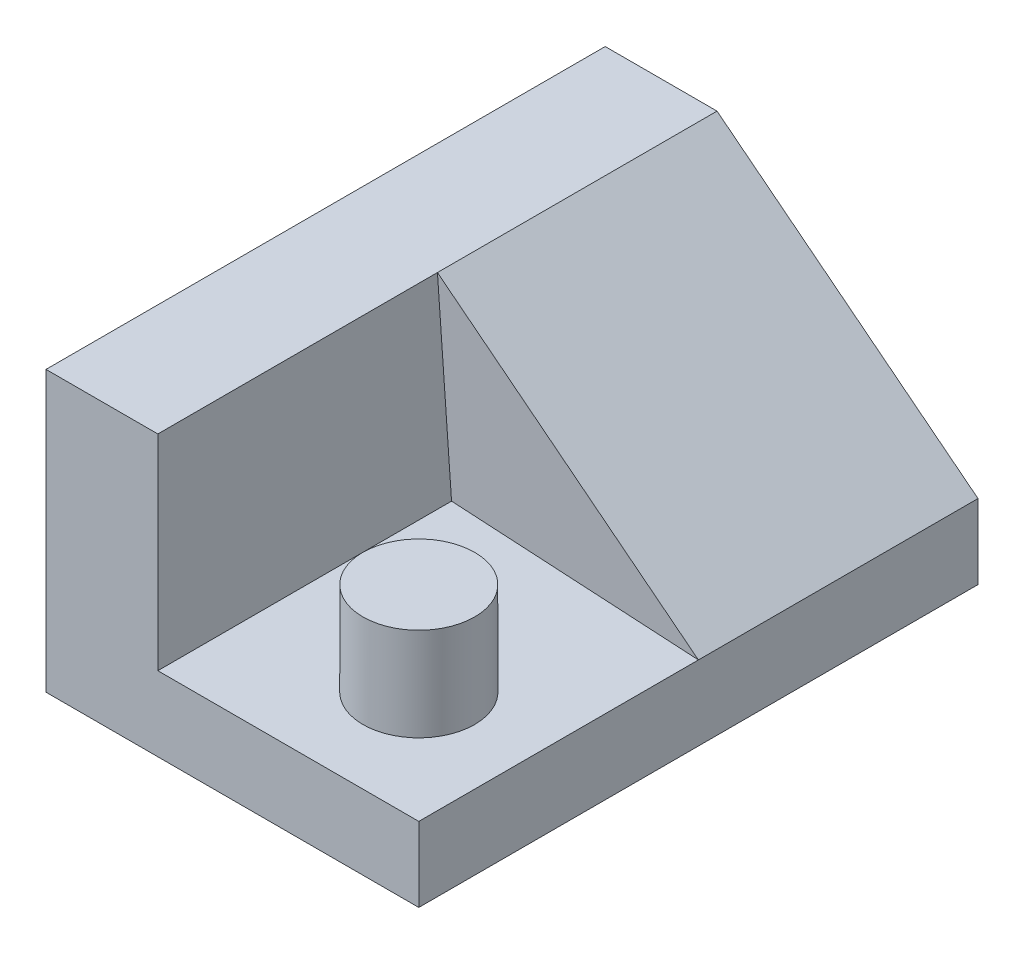
ISO-10303-21;
HEADER;
FILE_DESCRIPTION(('STEP AP214'),'2;1');
FILE_NAME('part.step','',(''),(''),'','','');
FILE_SCHEMA(('AUTOMOTIVE_DESIGN { 1 0 10303 214 1 1 1 1 }'));
ENDSEC;
DATA;
#1=APPLICATION_CONTEXT('core data for automotive mechanical design processes');
#2=APPLICATION_PROTOCOL_DEFINITION('international standard','automotive_design',2000,#1);
#3=PRODUCT_CONTEXT('',#1,'mechanical');
#4=PRODUCT('Part','Part','',(#3));
#5=PRODUCT_RELATED_PRODUCT_CATEGORY('part','',(#4));
#6=PRODUCT_DEFINITION_FORMATION('','',#4);
#7=PRODUCT_DEFINITION_CONTEXT('part definition',#1,'design');
#8=PRODUCT_DEFINITION('design','',#6,#7);
#9=PRODUCT_DEFINITION_SHAPE('','',#8);
#10=(LENGTH_UNIT() NAMED_UNIT(*) SI_UNIT(.MILLI.,.METRE.));
#11=(NAMED_UNIT(*) PLANE_ANGLE_UNIT() SI_UNIT($,.RADIAN.));
#12=(NAMED_UNIT(*) SI_UNIT($,.STERADIAN.) SOLID_ANGLE_UNIT());
#13=UNCERTAINTY_MEASURE_WITH_UNIT(LENGTH_MEASURE(1.E-05),#10,'distance_accuracy_value','');
#14=(GEOMETRIC_REPRESENTATION_CONTEXT(3) GLOBAL_UNCERTAINTY_ASSIGNED_CONTEXT((#13)) GLOBAL_UNIT_ASSIGNED_CONTEXT((#10,
#11,#12)) REPRESENTATION_CONTEXT('',''));
#15=CARTESIAN_POINT('',(0.,0.,0.));
#16=DIRECTION('',(0.,0.,1.));
#17=DIRECTION('',(1.,0.,0.));
#18=AXIS2_PLACEMENT_3D('',#15,#16,#17);
#19=CARTESIAN_POINT('',(100.,20.,150.));
#20=DIRECTION('',(0.,-1.,0.));
#21=DIRECTION('',(1.,0.,0.));
#22=AXIS2_PLACEMENT_3D('',#19,#20,#21);
#23=PLANE('',#22);
#24=DIRECTION('',(-0.998542363269422,0.,0.0539735931388368));
#25=VECTOR('',#24,1.);
#26=CARTESIAN_POINT('',(91.9157621129505,20.,0.43697231344747));
#27=LINE('',#26,#25);
#28=CARTESIAN_POINT('',(100.,20.,0.));
#29=VERTEX_POINT('',#28);
#30=CARTESIAN_POINT('',(30.,20.,3.78366673132242));
#31=VERTEX_POINT('',#30);
#32=EDGE_CURVE('E224',#29,#31,#27,.T.);
#33=ORIENTED_EDGE('',*,*,#32,.F.);
#34=DIRECTION('',(-1.,0.,0.));
#35=VECTOR('',#34,1.);
#36=CARTESIAN_POINT('',(100.,20.,0.));
#37=LINE('',#36,#35);
#38=CARTESIAN_POINT('',(30.,20.,0.));
#39=VERTEX_POINT('',#38);
#40=EDGE_CURVE('E134',#29,#39,#37,.T.);
#41=ORIENTED_EDGE('',*,*,#40,.T.);
#42=DIRECTION('',(0.,0.,-1.));
#43=VECTOR('',#42,1.);
#44=CARTESIAN_POINT('',(30.,20.,150.));
#45=LINE('',#44,#43);
#46=EDGE_CURVE('E116',#31,#39,#45,.T.);
#47=ORIENTED_EDGE('',*,*,#46,.F.);
#48=EDGE_LOOP('',(#33,#41,#47));
#49=FACE_BOUND('',#48,.T.);
#50=ADVANCED_FACE('F33',(#49),#23,.F.);
#51=CARTESIAN_POINT('',(30.,20.,150.));
#52=DIRECTION('',(-1.,0.,0.));
#53=DIRECTION('',(0.,0.,1.));
#54=AXIS2_PLACEMENT_3D('',#51,#52,#53);
#55=PLANE('',#54);
#56=DIRECTION('',(0.,0.997642062968162,-0.0686317287894636));
#57=VECTOR('',#56,1.);
#58=CARTESIAN_POINT('',(30.,9.9885823566259,4.47239160169713));
#59=LINE('',#58,#57);
#60=CARTESIAN_POINT('',(30.,75.,0.));
#61=VERTEX_POINT('',#60);
#62=EDGE_CURVE('E226',#31,#61,#59,.T.);
#63=ORIENTED_EDGE('',*,*,#62,.F.);
#64=ORIENTED_EDGE('',*,*,#46,.T.);
#65=DIRECTION('',(0.,1.,0.));
#66=VECTOR('',#65,1.);
#67=CARTESIAN_POINT('',(30.,20.,0.));
#68=LINE('',#67,#66);
#69=EDGE_CURVE('E137',#39,#61,#68,.T.);
#70=ORIENTED_EDGE('',*,*,#69,.T.);
#71=EDGE_LOOP('',(#63,#64,#70));
#72=FACE_BOUND('',#71,.T.);
#73=ADVANCED_FACE('F157',(#72),#55,.F.);
#74=CARTESIAN_POINT('',(0.,75.,150.));
#75=DIRECTION('',(1.,0.,0.));
#76=DIRECTION('',(0.,1.,0.));
#77=AXIS2_PLACEMENT_3D('',#74,#75,#76);
#78=PLANE('',#77);
#79=DIRECTION('',(0.,0.,-1.));
#80=VECTOR('',#79,1.);
#81=CARTESIAN_POINT('',(0.,75.,150.));
#82=LINE('',#81,#80);
#83=CARTESIAN_POINT('',(0.,75.,150.));
#84=VERTEX_POINT('',#83);
#85=CARTESIAN_POINT('',(0.,75.,0.));
#86=VERTEX_POINT('',#85);
#87=EDGE_CURVE('E78',#84,#86,#82,.T.);
#88=ORIENTED_EDGE('',*,*,#87,.T.);
#89=DIRECTION('',(0.,-1.,0.));
#90=VECTOR('',#89,1.);
#91=CARTESIAN_POINT('',(0.,75.,0.));
#92=LINE('',#91,#90);
#93=CARTESIAN_POINT('',(0.,0.,0.));
#94=VERTEX_POINT('',#93);
#95=EDGE_CURVE('E125',#86,#94,#92,.T.);
#96=ORIENTED_EDGE('',*,*,#95,.T.);
#97=DIRECTION('',(0.,0.,-1.));
#98=VECTOR('',#97,1.);
#99=CARTESIAN_POINT('',(0.,0.,150.));
#100=LINE('',#99,#98);
#101=CARTESIAN_POINT('',(0.,0.,150.));
#102=VERTEX_POINT('',#101);
#103=EDGE_CURVE('E42',#102,#94,#100,.T.);
#104=ORIENTED_EDGE('',*,*,#103,.F.);
#105=DIRECTION('',(0.,-1.,0.));
#106=VECTOR('',#105,1.);
#107=CARTESIAN_POINT('',(0.,75.,150.));
#108=LINE('',#107,#106);
#109=EDGE_CURVE('E142',#84,#102,#108,.T.);
#110=ORIENTED_EDGE('',*,*,#109,.F.);
#111=EDGE_LOOP('',(#88,#96,#104,#110));
#112=FACE_BOUND('',#111,.T.);
#113=ADVANCED_FACE('F35',(#112),#78,.F.);
#114=CARTESIAN_POINT('',(0.,0.,150.));
#115=DIRECTION('',(0.,1.,0.));
#116=DIRECTION('',(0.,0.,1.));
#117=AXIS2_PLACEMENT_3D('',#114,#115,#116);
#118=PLANE('',#117);
#119=ORIENTED_EDGE('',*,*,#103,.T.);
#120=DIRECTION('',(1.,0.,0.));
#121=VECTOR('',#120,1.);
#122=CARTESIAN_POINT('',(0.,0.,0.));
#123=LINE('',#122,#121);
#124=CARTESIAN_POINT('',(100.,0.,0.));
#125=VERTEX_POINT('',#124);
#126=EDGE_CURVE('E127',#94,#125,#123,.T.);
#127=ORIENTED_EDGE('',*,*,#126,.T.);
#128=DIRECTION('',(0.,0.,-1.));
#129=VECTOR('',#128,1.);
#130=CARTESIAN_POINT('',(100.,0.,150.));
#131=LINE('',#130,#129);
#132=CARTESIAN_POINT('',(100.,0.,150.));
#133=VERTEX_POINT('',#132);
#134=EDGE_CURVE('E146',#133,#125,#131,.T.);
#135=ORIENTED_EDGE('',*,*,#134,.F.);
#136=DIRECTION('',(1.,0.,0.));
#137=VECTOR('',#136,1.);
#138=CARTESIAN_POINT('',(0.,0.,150.));
#139=LINE('',#138,#137);
#140=EDGE_CURVE('E86',#102,#133,#139,.T.);
#141=ORIENTED_EDGE('',*,*,#140,.F.);
#142=EDGE_LOOP('',(#119,#127,#135,#141));
#143=FACE_BOUND('',#142,.T.);
#144=ADVANCED_FACE('F149',(#143),#118,.F.);
#145=CARTESIAN_POINT('',(100.,0.,150.));
#146=DIRECTION('',(-1.,0.,0.));
#147=DIRECTION('',(0.,0.,1.));
#148=AXIS2_PLACEMENT_3D('',#145,#146,#147);
#149=PLANE('',#148);
#150=ORIENTED_EDGE('',*,*,#134,.T.);
#151=DIRECTION('',(0.,1.,0.));
#152=VECTOR('',#151,1.);
#153=CARTESIAN_POINT('',(100.,0.,0.));
#154=LINE('',#153,#152);
#155=EDGE_CURVE('E131',#125,#29,#154,.T.);
#156=ORIENTED_EDGE('',*,*,#155,.T.);
#157=DIRECTION('',(0.,0.,-1.));
#158=VECTOR('',#157,1.);
#159=CARTESIAN_POINT('',(100.,20.,150.));
#160=LINE('',#159,#158);
#161=CARTESIAN_POINT('',(100.,20.,75.));
#162=VERTEX_POINT('',#161);
#163=EDGE_CURVE('E217',#29,#162,#160,.F.);
#164=ORIENTED_EDGE('',*,*,#163,.T.);
#165=DIRECTION('',(0.,0.,-1.));
#166=VECTOR('',#165,1.);
#167=CARTESIAN_POINT('',(100.,20.,150.));
#168=LINE('',#167,#166);
#169=CARTESIAN_POINT('',(100.,20.,150.));
#170=VERTEX_POINT('',#169);
#171=EDGE_CURVE('E115',#170,#162,#168,.T.);
#172=ORIENTED_EDGE('',*,*,#171,.F.);
#173=DIRECTION('',(0.,1.,0.));
#174=VECTOR('',#173,1.);
#175=CARTESIAN_POINT('',(100.,0.,150.));
#176=LINE('',#175,#174);
#177=EDGE_CURVE('E102',#133,#170,#176,.T.);
#178=ORIENTED_EDGE('',*,*,#177,.F.);
#179=EDGE_LOOP('',(#150,#156,#164,#172,#178));
#180=FACE_BOUND('',#179,.T.);
#181=ADVANCED_FACE('F162',(#180),#149,.F.);
#182=CARTESIAN_POINT('',(70.,20.,120.));
#183=DIRECTION('',(0.,-1.,0.));
#184=DIRECTION('',(1.,0.,0.));
#185=AXIS2_PLACEMENT_3D('',#182,#183,#184);
#186=CIRCLE('',#185,15.);
#187=CARTESIAN_POINT('',(85.,20.,120.));
#188=VERTEX_POINT('',#187);
#189=EDGE_CURVE('E11',#188,#188,#186,.F.);
#190=ORIENTED_EDGE('',*,*,#189,.F.);
#191=EDGE_LOOP('',(#190));
#192=FACE_BOUND('',#191,.T.);
#193=ORIENTED_EDGE('',*,*,#171,.T.);
#194=DIRECTION('',(-0.998542363269422,0.,-0.0539735931388368));
#195=VECTOR('',#194,1.);
#196=CARTESIAN_POINT('',(104.042118943525,20.,75.2184861567237));
#197=LINE('',#196,#195);
#198=CARTESIAN_POINT('',(30.,20.,71.2163332686776));
#199=VERTEX_POINT('',#198);
#200=EDGE_CURVE('E112',#162,#199,#197,.T.);
#201=ORIENTED_EDGE('',*,*,#200,.T.);
#202=CARTESIAN_POINT('',(30.,20.,150.));
#203=VERTEX_POINT('',#202);
#204=EDGE_CURVE('E109',#203,#199,#45,.T.);
#205=ORIENTED_EDGE('',*,*,#204,.F.);
#206=DIRECTION('',(-1.,0.,0.));
#207=VECTOR('',#206,1.);
#208=CARTESIAN_POINT('',(100.,20.,150.));
#209=LINE('',#208,#207);
#210=EDGE_CURVE('E95',#170,#203,#209,.T.);
#211=ORIENTED_EDGE('',*,*,#210,.F.);
#212=EDGE_LOOP('',(#193,#201,#205,#211));
#213=FACE_BOUND('',#212,.T.);
#214=ADVANCED_FACE('F110',(#192,#213),#23,.F.);
#215=ORIENTED_EDGE('',*,*,#204,.T.);
#216=DIRECTION('',(0.,0.997642062968162,0.0686317287894636));
#217=VECTOR('',#216,1.);
#218=CARTESIAN_POINT('',(30.,25.3943097429091,71.5874290925447));
#219=LINE('',#218,#217);
#220=CARTESIAN_POINT('',(30.,75.,75.));
#221=VERTEX_POINT('',#220);
#222=EDGE_CURVE('E220',#199,#221,#219,.T.);
#223=ORIENTED_EDGE('',*,*,#222,.T.);
#224=DIRECTION('',(0.,0.,-1.));
#225=VECTOR('',#224,1.);
#226=CARTESIAN_POINT('',(30.,75.,150.));
#227=LINE('',#226,#225);
#228=CARTESIAN_POINT('',(30.,75.,150.));
#229=VERTEX_POINT('',#228);
#230=EDGE_CURVE('E120',#229,#221,#227,.T.);
#231=ORIENTED_EDGE('',*,*,#230,.F.);
#232=DIRECTION('',(0.,1.,0.));
#233=VECTOR('',#232,1.);
#234=CARTESIAN_POINT('',(30.,20.,150.));
#235=LINE('',#234,#233);
#236=EDGE_CURVE('E99',#203,#229,#235,.T.);
#237=ORIENTED_EDGE('',*,*,#236,.F.);
#238=EDGE_LOOP('',(#215,#223,#231,#237));
#239=FACE_BOUND('',#238,.T.);
#240=ADVANCED_FACE('F118',(#239),#55,.F.);
#241=CARTESIAN_POINT('',(30.,75.,150.));
#242=DIRECTION('',(0.,-1.,0.));
#243=DIRECTION('',(0.,0.,-1.));
#244=AXIS2_PLACEMENT_3D('',#241,#242,#243);
#245=PLANE('',#244);
#246=ORIENTED_EDGE('',*,*,#230,.T.);
#247=DIRECTION('',(0.,0.,-1.));
#248=VECTOR('',#247,1.);
#249=CARTESIAN_POINT('',(30.,75.,150.));
#250=LINE('',#249,#248);
#251=EDGE_CURVE('E206',#61,#221,#250,.F.);
#252=ORIENTED_EDGE('',*,*,#251,.F.);
#253=DIRECTION('',(-1.,0.,0.));
#254=VECTOR('',#253,1.);
#255=CARTESIAN_POINT('',(30.,75.,0.));
#256=LINE('',#255,#254);
#257=EDGE_CURVE('E140',#61,#86,#256,.T.);
#258=ORIENTED_EDGE('',*,*,#257,.T.);
#259=ORIENTED_EDGE('',*,*,#87,.F.);
#260=DIRECTION('',(-1.,0.,0.));
#261=VECTOR('',#260,1.);
#262=CARTESIAN_POINT('',(30.,75.,150.));
#263=LINE('',#262,#261);
#264=EDGE_CURVE('E50',#229,#84,#263,.T.);
#265=ORIENTED_EDGE('',*,*,#264,.F.);
#266=EDGE_LOOP('',(#246,#252,#258,#259,#265));
#267=FACE_BOUND('',#266,.T.);
#268=ADVANCED_FACE('F178',(#267),#245,.F.);
#269=CARTESIAN_POINT('',(0.,0.,150.));
#270=DIRECTION('',(0.,0.,1.));
#271=DIRECTION('',(1.,0.,0.));
#272=AXIS2_PLACEMENT_3D('',#269,#270,#271);
#273=PLANE('',#272);
#274=ORIENTED_EDGE('',*,*,#109,.T.);
#275=ORIENTED_EDGE('',*,*,#140,.T.);
#276=ORIENTED_EDGE('',*,*,#177,.T.);
#277=ORIENTED_EDGE('',*,*,#210,.T.);
#278=ORIENTED_EDGE('',*,*,#236,.T.);
#279=ORIENTED_EDGE('',*,*,#264,.T.);
#280=EDGE_LOOP('',(#274,#275,#276,#277,#278,#279));
#281=FACE_BOUND('',#280,.T.);
#282=ADVANCED_FACE('F97',(#281),#273,.T.);
#283=CARTESIAN_POINT('',(0.,0.,0.));
#284=DIRECTION('',(0.,0.,1.));
#285=DIRECTION('',(1.,0.,0.));
#286=AXIS2_PLACEMENT_3D('',#283,#284,#285);
#287=PLANE('',#286);
#288=ORIENTED_EDGE('',*,*,#95,.F.);
#289=ORIENTED_EDGE('',*,*,#257,.F.);
#290=ORIENTED_EDGE('',*,*,#69,.F.);
#291=ORIENTED_EDGE('',*,*,#40,.F.);
#292=ORIENTED_EDGE('',*,*,#155,.F.);
#293=ORIENTED_EDGE('',*,*,#126,.F.);
#294=EDGE_LOOP('',(#288,#289,#290,#291,#292,#293));
#295=FACE_BOUND('',#294,.T.);
#296=ADVANCED_FACE('F153',(#295),#287,.F.);
#297=CARTESIAN_POINT('',(70.,45.,120.));
#298=DIRECTION('',(0.,-1.,0.));
#299=DIRECTION('',(1.,0.,0.));
#300=AXIS2_PLACEMENT_3D('',#297,#298,#299);
#301=CYLINDRICAL_SURFACE('',#300,15.);
#302=CARTESIAN_POINT('',(70.,45.,120.));
#303=DIRECTION('',(0.,1.,0.));
#304=DIRECTION('',(-1.,0.,0.));
#305=AXIS2_PLACEMENT_3D('',#302,#303,#304);
#306=CIRCLE('',#305,15.);
#307=CARTESIAN_POINT('',(55.,45.,120.));
#308=VERTEX_POINT('',#307);
#309=EDGE_CURVE('E128',#308,#308,#306,.T.);
#310=ORIENTED_EDGE('',*,*,#309,.F.);
#311=EDGE_LOOP('',(#310));
#312=FACE_BOUND('',#311,.T.);
#313=ORIENTED_EDGE('',*,*,#189,.T.);
#314=EDGE_LOOP('',(#313));
#315=FACE_BOUND('',#314,.T.);
#316=ADVANCED_FACE('F182',(#312,#315),#301,.T.);
#317=CARTESIAN_POINT('',(70.,45.,120.));
#318=DIRECTION('',(0.,1.,0.));
#319=DIRECTION('',(-1.,0.,0.));
#320=AXIS2_PLACEMENT_3D('',#317,#318,#319);
#321=PLANE('',#320);
#322=ORIENTED_EDGE('',*,*,#309,.T.);
#323=EDGE_LOOP('',(#322));
#324=FACE_BOUND('',#323,.T.);
#325=ADVANCED_FACE('F184',(#324),#321,.T.);
#326=CARTESIAN_POINT('',(60.583596214511,50.9700315457413,75.));
#327=DIRECTION('',(-0.0538466962441359,-0.068532158856173,0.996194698091746));
#328=DIRECTION('',(0.,-0.997642062968162,-0.0686317287894636));
#329=AXIS2_PLACEMENT_3D('',#326,#327,#328);
#330=PLANE('',#329);
#331=ORIENTED_EDGE('',*,*,#200,.F.);
#332=DIRECTION('',(-0.786318338822423,0.617821551931903,0.));
#333=VECTOR('',#332,1.);
#334=CARTESIAN_POINT('',(30.,75.,75.));
#335=LINE('',#334,#333);
#336=EDGE_CURVE('E219',#221,#162,#335,.F.);
#337=ORIENTED_EDGE('',*,*,#336,.F.);
#338=ORIENTED_EDGE('',*,*,#222,.F.);
#339=EDGE_LOOP('',(#331,#337,#338));
#340=FACE_BOUND('',#339,.T.);
#341=ADVANCED_FACE('F191',(#340),#330,.T.);
#342=CARTESIAN_POINT('',(30.,75.,0.));
#343=DIRECTION('',(-0.617821551931903,-0.786318338822423,0.));
#344=DIRECTION('',(0.786318338822423,-0.617821551931903,0.));
#345=AXIS2_PLACEMENT_3D('',#342,#343,#344);
#346=PLANE('',#345);
#347=ORIENTED_EDGE('',*,*,#163,.F.);
#348=DIRECTION('',(0.786318338822423,-0.617821551931903,0.));
#349=VECTOR('',#348,1.);
#350=CARTESIAN_POINT('',(60.583596214511,50.9700315457413,0.));
#351=LINE('',#350,#349);
#352=EDGE_CURVE('E71',#61,#29,#351,.T.);
#353=ORIENTED_EDGE('',*,*,#352,.F.);
#354=ORIENTED_EDGE('',*,*,#251,.T.);
#355=ORIENTED_EDGE('',*,*,#336,.T.);
#356=EDGE_LOOP('',(#347,#353,#354,#355));
#357=FACE_BOUND('',#356,.T.);
#358=ADVANCED_FACE('F218',(#357),#346,.F.);
#359=CARTESIAN_POINT('',(60.583596214511,50.9700315457413,0.));
#360=DIRECTION('',(0.0538466962441359,0.068532158856173,0.996194698091746));
#361=DIRECTION('',(0.,-0.997642062968162,0.0686317287894636));
#362=AXIS2_PLACEMENT_3D('',#359,#360,#361);
#363=PLANE('',#362);
#364=ORIENTED_EDGE('',*,*,#352,.T.);
#365=ORIENTED_EDGE('',*,*,#32,.T.);
#366=ORIENTED_EDGE('',*,*,#62,.T.);
#367=EDGE_LOOP('',(#364,#365,#366));
#368=FACE_BOUND('',#367,.T.);
#369=ADVANCED_FACE('F223',(#368),#363,.F.);
#370=CLOSED_SHELL('',(#50,#73,#113,#144,#181,#214,#240,#268,#282,#296,#316,#325,#341,#358,#369));
#371=MANIFOLD_SOLID_BREP('B2',#370);
#372=ADVANCED_BREP_SHAPE_REPRESENTATION('',(#18,#371),#14);
#373=SHAPE_DEFINITION_REPRESENTATION(#9,#372);
ENDSEC;
END-ISO-10303-21;
